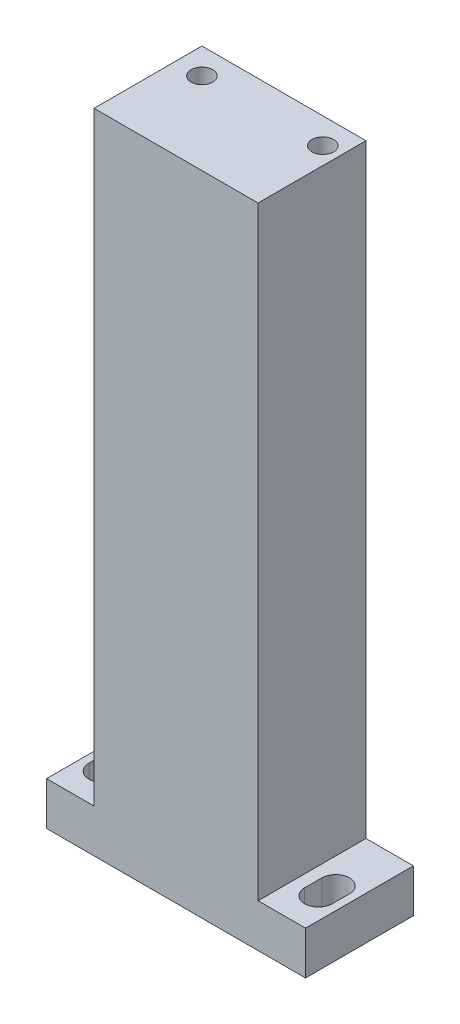
ISO-10303-21;
HEADER;
FILE_DESCRIPTION(('STEP AP214'),'2;1');
FILE_NAME('part.step','',(''),(''),'','','');
FILE_SCHEMA(('AUTOMOTIVE_DESIGN { 1 0 10303 214 1 1 1 1 }'));
ENDSEC;
DATA;
#1=APPLICATION_CONTEXT('core data for automotive mechanical design processes');
#2=APPLICATION_PROTOCOL_DEFINITION('international standard','automotive_design',2000,#1);
#3=PRODUCT_CONTEXT('',#1,'mechanical');
#4=PRODUCT('Part','Part','',(#3));
#5=PRODUCT_RELATED_PRODUCT_CATEGORY('part','',(#4));
#6=PRODUCT_DEFINITION_FORMATION('','',#4);
#7=PRODUCT_DEFINITION_CONTEXT('part definition',#1,'design');
#8=PRODUCT_DEFINITION('design','',#6,#7);
#9=PRODUCT_DEFINITION_SHAPE('','',#8);
#10=(LENGTH_UNIT() NAMED_UNIT(*) SI_UNIT(.MILLI.,.METRE.));
#11=(NAMED_UNIT(*) PLANE_ANGLE_UNIT() SI_UNIT($,.RADIAN.));
#12=(NAMED_UNIT(*) SI_UNIT($,.STERADIAN.) SOLID_ANGLE_UNIT());
#13=UNCERTAINTY_MEASURE_WITH_UNIT(LENGTH_MEASURE(1.E-05),#10,'distance_accuracy_value','');
#14=(GEOMETRIC_REPRESENTATION_CONTEXT(3) GLOBAL_UNCERTAINTY_ASSIGNED_CONTEXT((#13)) GLOBAL_UNIT_ASSIGNED_CONTEXT((#10,
#11,#12)) REPRESENTATION_CONTEXT('',''));
#15=CARTESIAN_POINT('',(0.,0.,0.));
#16=DIRECTION('',(0.,0.,1.));
#17=DIRECTION('',(1.,0.,0.));
#18=AXIS2_PLACEMENT_3D('',#15,#16,#17);
#19=CARTESIAN_POINT('',(0.,10.,0.));
#20=DIRECTION('',(0.,1.,0.));
#21=DIRECTION('',(0.,0.,1.));
#22=AXIS2_PLACEMENT_3D('',#19,#20,#21);
#23=PLANE('',#22);
#24=CARTESIAN_POINT('',(25.,10.,4.5));
#25=DIRECTION('',(0.,1.,0.));
#26=DIRECTION('',(0.,0.,1.));
#27=AXIS2_PLACEMENT_3D('',#24,#25,#26);
#28=CIRCLE('',#27,3.2);
#29=CARTESIAN_POINT('',(21.8,10.,4.5));
#30=VERTEX_POINT('',#29);
#31=CARTESIAN_POINT('',(28.2,10.,4.5));
#32=VERTEX_POINT('',#31);
#33=EDGE_CURVE('E55',#30,#32,#28,.T.);
#34=ORIENTED_EDGE('',*,*,#33,.F.);
#35=DIRECTION('',(0.,0.,1.));
#36=VECTOR('',#35,1.);
#37=CARTESIAN_POINT('',(21.8,10.,4.5));
#38=LINE('',#37,#36);
#39=CARTESIAN_POINT('',(21.8,10.,0.499999999999999));
#40=VERTEX_POINT('',#39);
#41=EDGE_CURVE('E204',#40,#30,#38,.T.);
#42=ORIENTED_EDGE('',*,*,#41,.F.);
#43=CARTESIAN_POINT('',(25.,10.,0.499999999999999));
#44=DIRECTION('',(0.,1.,0.));
#45=DIRECTION('',(0.,0.,1.));
#46=AXIS2_PLACEMENT_3D('',#43,#44,#45);
#47=CIRCLE('',#46,3.2);
#48=CARTESIAN_POINT('',(28.2,10.,0.499999999999998));
#49=VERTEX_POINT('',#48);
#50=EDGE_CURVE('E200',#49,#40,#47,.T.);
#51=ORIENTED_EDGE('',*,*,#50,.F.);
#52=DIRECTION('',(0.,0.,-1.));
#53=VECTOR('',#52,1.);
#54=CARTESIAN_POINT('',(28.2,10.,4.5));
#55=LINE('',#54,#53);
#56=EDGE_CURVE('E196',#32,#49,#55,.T.);
#57=ORIENTED_EDGE('',*,*,#56,.F.);
#58=EDGE_LOOP('',(#34,#42,#51,#57));
#59=FACE_BOUND('',#58,.T.);
#60=DIRECTION('',(0.,0.,-1.));
#61=VECTOR('',#60,1.);
#62=CARTESIAN_POINT('',(19.,10.,-12.5));
#63=LINE('',#62,#61);
#64=CARTESIAN_POINT('',(19.,10.,12.5));
#65=VERTEX_POINT('',#64);
#66=CARTESIAN_POINT('',(19.,10.,-12.5));
#67=VERTEX_POINT('',#66);
#68=EDGE_CURVE('E224',#65,#67,#63,.T.);
#69=ORIENTED_EDGE('',*,*,#68,.F.);
#70=DIRECTION('',(1.,0.,0.));
#71=VECTOR('',#70,1.);
#72=CARTESIAN_POINT('',(-30.,10.,12.5));
#73=LINE('',#72,#71);
#74=CARTESIAN_POINT('',(30.,10.,12.5));
#75=VERTEX_POINT('',#74);
#76=EDGE_CURVE('E285',#65,#75,#73,.T.);
#77=ORIENTED_EDGE('',*,*,#76,.T.);
#78=DIRECTION('',(0.,0.,-1.));
#79=VECTOR('',#78,1.);
#80=CARTESIAN_POINT('',(30.,10.,-12.5));
#81=LINE('',#80,#79);
#82=CARTESIAN_POINT('',(30.,10.,-12.5));
#83=VERTEX_POINT('',#82);
#84=EDGE_CURVE('E273',#75,#83,#81,.T.);
#85=ORIENTED_EDGE('',*,*,#84,.T.);
#86=DIRECTION('',(-1.,0.,0.));
#87=VECTOR('',#86,1.);
#88=CARTESIAN_POINT('',(-30.,10.,-12.5));
#89=LINE('',#88,#87);
#90=EDGE_CURVE('E279',#83,#67,#89,.T.);
#91=ORIENTED_EDGE('',*,*,#90,.T.);
#92=EDGE_LOOP('',(#69,#77,#85,#91));
#93=FACE_BOUND('',#92,.T.);
#94=ADVANCED_FACE('F39',(#59,#93),#23,.T.);
#95=CARTESIAN_POINT('',(30.,10.,-12.5));
#96=DIRECTION('',(-1.,0.,0.));
#97=DIRECTION('',(0.,0.,1.));
#98=AXIS2_PLACEMENT_3D('',#95,#96,#97);
#99=PLANE('',#98);
#100=DIRECTION('',(0.,0.,-1.));
#101=VECTOR('',#100,1.);
#102=CARTESIAN_POINT('',(30.,0.,-12.5));
#103=LINE('',#102,#101);
#104=CARTESIAN_POINT('',(30.,0.,12.5));
#105=VERTEX_POINT('',#104);
#106=CARTESIAN_POINT('',(30.,0.,-12.5));
#107=VERTEX_POINT('',#106);
#108=EDGE_CURVE('E272',#105,#107,#103,.T.);
#109=ORIENTED_EDGE('',*,*,#108,.T.);
#110=DIRECTION('',(0.,-1.,0.));
#111=VECTOR('',#110,1.);
#112=CARTESIAN_POINT('',(30.,10.,-12.5));
#113=LINE('',#112,#111);
#114=EDGE_CURVE('E312',#83,#107,#113,.T.);
#115=ORIENTED_EDGE('',*,*,#114,.F.);
#116=ORIENTED_EDGE('',*,*,#84,.F.);
#117=DIRECTION('',(0.,-1.,0.));
#118=VECTOR('',#117,1.);
#119=CARTESIAN_POINT('',(30.,10.,12.5));
#120=LINE('',#119,#118);
#121=EDGE_CURVE('E289',#75,#105,#120,.T.);
#122=ORIENTED_EDGE('',*,*,#121,.T.);
#123=EDGE_LOOP('',(#109,#115,#116,#122));
#124=FACE_BOUND('',#123,.T.);
#125=ADVANCED_FACE('F41',(#124),#99,.F.);
#126=CARTESIAN_POINT('',(-30.,10.,-12.5));
#127=DIRECTION('',(0.,0.,1.));
#128=DIRECTION('',(1.,0.,0.));
#129=AXIS2_PLACEMENT_3D('',#126,#127,#128);
#130=PLANE('',#129);
#131=DIRECTION('',(-1.,0.,0.));
#132=VECTOR('',#131,1.);
#133=CARTESIAN_POINT('',(-30.,0.,-12.5));
#134=LINE('',#133,#132);
#135=CARTESIAN_POINT('',(-30.,0.,-12.5));
#136=VERTEX_POINT('',#135);
#137=EDGE_CURVE('E293',#107,#136,#134,.T.);
#138=ORIENTED_EDGE('',*,*,#137,.T.);
#139=DIRECTION('',(0.,-1.,0.));
#140=VECTOR('',#139,1.);
#141=CARTESIAN_POINT('',(-30.,10.,-12.5));
#142=LINE('',#141,#140);
#143=CARTESIAN_POINT('',(-30.,10.,-12.5));
#144=VERTEX_POINT('',#143);
#145=EDGE_CURVE('E308',#144,#136,#142,.T.);
#146=ORIENTED_EDGE('',*,*,#145,.F.);
#147=CARTESIAN_POINT('',(-19.,10.,-12.5));
#148=VERTEX_POINT('',#147);
#149=EDGE_CURVE('E277',#148,#144,#89,.T.);
#150=ORIENTED_EDGE('',*,*,#149,.F.);
#151=DIRECTION('',(0.,-1.,0.));
#152=VECTOR('',#151,1.);
#153=CARTESIAN_POINT('',(-19.,150.,-12.5));
#154=LINE('',#153,#152);
#155=CARTESIAN_POINT('',(-19.,150.,-12.5));
#156=VERTEX_POINT('',#155);
#157=EDGE_CURVE('E264',#156,#148,#154,.T.);
#158=ORIENTED_EDGE('',*,*,#157,.F.);
#159=DIRECTION('',(-1.,0.,0.));
#160=VECTOR('',#159,1.);
#161=CARTESIAN_POINT('',(-19.,150.,-12.5));
#162=LINE('',#161,#160);
#163=CARTESIAN_POINT('',(19.,150.,-12.5));
#164=VERTEX_POINT('',#163);
#165=EDGE_CURVE('E240',#164,#156,#162,.T.);
#166=ORIENTED_EDGE('',*,*,#165,.F.);
#167=DIRECTION('',(0.,-1.,0.));
#168=VECTOR('',#167,1.);
#169=CARTESIAN_POINT('',(19.,150.,-12.5));
#170=LINE('',#169,#168);
#171=EDGE_CURVE('E268',#164,#67,#170,.T.);
#172=ORIENTED_EDGE('',*,*,#171,.T.);
#173=ORIENTED_EDGE('',*,*,#90,.F.);
#174=ORIENTED_EDGE('',*,*,#114,.T.);
#175=EDGE_LOOP('',(#138,#146,#150,#158,#166,#172,#173,#174));
#176=FACE_BOUND('',#175,.T.);
#177=ADVANCED_FACE('F364',(#176),#130,.F.);
#178=CARTESIAN_POINT('',(-30.,10.,-12.5));
#179=DIRECTION('',(1.,0.,0.));
#180=DIRECTION('',(0.,0.,-1.));
#181=AXIS2_PLACEMENT_3D('',#178,#179,#180);
#182=PLANE('',#181);
#183=DIRECTION('',(0.,0.,1.));
#184=VECTOR('',#183,1.);
#185=CARTESIAN_POINT('',(-30.,0.,-12.5));
#186=LINE('',#185,#184);
#187=CARTESIAN_POINT('',(-30.,0.,12.5));
#188=VERTEX_POINT('',#187);
#189=EDGE_CURVE('E296',#136,#188,#186,.T.);
#190=ORIENTED_EDGE('',*,*,#189,.T.);
#191=DIRECTION('',(0.,-1.,0.));
#192=VECTOR('',#191,1.);
#193=CARTESIAN_POINT('',(-30.,10.,12.5));
#194=LINE('',#193,#192);
#195=CARTESIAN_POINT('',(-30.,10.,12.5));
#196=VERTEX_POINT('',#195);
#197=EDGE_CURVE('E304',#196,#188,#194,.T.);
#198=ORIENTED_EDGE('',*,*,#197,.F.);
#199=DIRECTION('',(0.,0.,1.));
#200=VECTOR('',#199,1.);
#201=CARTESIAN_POINT('',(-30.,10.,-12.5));
#202=LINE('',#201,#200);
#203=EDGE_CURVE('E282',#144,#196,#202,.T.);
#204=ORIENTED_EDGE('',*,*,#203,.F.);
#205=ORIENTED_EDGE('',*,*,#145,.T.);
#206=EDGE_LOOP('',(#190,#198,#204,#205));
#207=FACE_BOUND('',#206,.T.);
#208=ADVANCED_FACE('F376',(#207),#182,.F.);
#209=CARTESIAN_POINT('',(-30.,10.,12.5));
#210=DIRECTION('',(0.,0.,-1.));
#211=DIRECTION('',(-1.,0.,0.));
#212=AXIS2_PLACEMENT_3D('',#209,#210,#211);
#213=PLANE('',#212);
#214=DIRECTION('',(1.,0.,0.));
#215=VECTOR('',#214,1.);
#216=CARTESIAN_POINT('',(-30.,0.,12.5));
#217=LINE('',#216,#215);
#218=EDGE_CURVE('E278',#188,#105,#217,.T.);
#219=ORIENTED_EDGE('',*,*,#218,.T.);
#220=ORIENTED_EDGE('',*,*,#121,.F.);
#221=ORIENTED_EDGE('',*,*,#76,.F.);
#222=DIRECTION('',(0.,-1.,0.));
#223=VECTOR('',#222,1.);
#224=CARTESIAN_POINT('',(19.,150.,12.5));
#225=LINE('',#224,#223);
#226=CARTESIAN_POINT('',(19.,150.,12.5));
#227=VERTEX_POINT('',#226);
#228=EDGE_CURVE('E250',#227,#65,#225,.T.);
#229=ORIENTED_EDGE('',*,*,#228,.F.);
#230=DIRECTION('',(1.,0.,0.));
#231=VECTOR('',#230,1.);
#232=CARTESIAN_POINT('',(-19.,150.,12.5));
#233=LINE('',#232,#231);
#234=CARTESIAN_POINT('',(-19.,150.,12.5));
#235=VERTEX_POINT('',#234);
#236=EDGE_CURVE('E247',#235,#227,#233,.T.);
#237=ORIENTED_EDGE('',*,*,#236,.F.);
#238=DIRECTION('',(0.,-1.,0.));
#239=VECTOR('',#238,1.);
#240=CARTESIAN_POINT('',(-19.,150.,12.5));
#241=LINE('',#240,#239);
#242=CARTESIAN_POINT('',(-19.,10.,12.5));
#243=VERTEX_POINT('',#242);
#244=EDGE_CURVE('E260',#235,#243,#241,.T.);
#245=ORIENTED_EDGE('',*,*,#244,.T.);
#246=EDGE_CURVE('E286',#196,#243,#73,.T.);
#247=ORIENTED_EDGE('',*,*,#246,.F.);
#248=ORIENTED_EDGE('',*,*,#197,.T.);
#249=EDGE_LOOP('',(#219,#220,#221,#229,#237,#245,#247,#248));
#250=FACE_BOUND('',#249,.T.);
#251=ADVANCED_FACE('F370',(#250),#213,.F.);
#252=CARTESIAN_POINT('',(-25.,10.,4.5));
#253=DIRECTION('',(0.,1.,0.));
#254=DIRECTION('',(0.,0.,1.));
#255=AXIS2_PLACEMENT_3D('',#252,#253,#254);
#256=CIRCLE('',#255,3.20000000000001);
#257=CARTESIAN_POINT('',(-28.2,10.,4.5));
#258=VERTEX_POINT('',#257);
#259=CARTESIAN_POINT('',(-21.8,10.,4.5));
#260=VERTEX_POINT('',#259);
#261=EDGE_CURVE('E63',#258,#260,#256,.T.);
#262=ORIENTED_EDGE('',*,*,#261,.F.);
#263=DIRECTION('',(0.,0.,1.));
#264=VECTOR('',#263,1.);
#265=CARTESIAN_POINT('',(-28.2,10.,4.5));
#266=LINE('',#265,#264);
#267=CARTESIAN_POINT('',(-28.2,10.,0.5));
#268=VERTEX_POINT('',#267);
#269=EDGE_CURVE('E179',#268,#258,#266,.T.);
#270=ORIENTED_EDGE('',*,*,#269,.F.);
#271=CARTESIAN_POINT('',(-25.,10.,0.499999999999999));
#272=DIRECTION('',(0.,1.,0.));
#273=DIRECTION('',(0.,0.,1.));
#274=AXIS2_PLACEMENT_3D('',#271,#272,#273);
#275=CIRCLE('',#274,3.20000000000001);
#276=CARTESIAN_POINT('',(-21.8,10.,0.499999999999998));
#277=VERTEX_POINT('',#276);
#278=EDGE_CURVE('E160',#277,#268,#275,.T.);
#279=ORIENTED_EDGE('',*,*,#278,.F.);
#280=DIRECTION('',(0.,0.,-1.));
#281=VECTOR('',#280,1.);
#282=CARTESIAN_POINT('',(-21.8,10.,4.5));
#283=LINE('',#282,#281);
#284=EDGE_CURVE('E171',#260,#277,#283,.T.);
#285=ORIENTED_EDGE('',*,*,#284,.F.);
#286=EDGE_LOOP('',(#262,#270,#279,#285));
#287=FACE_BOUND('',#286,.T.);
#288=DIRECTION('',(0.,0.,1.));
#289=VECTOR('',#288,1.);
#290=CARTESIAN_POINT('',(-19.,10.,-12.5));
#291=LINE('',#290,#289);
#292=EDGE_CURVE('E241',#148,#243,#291,.T.);
#293=ORIENTED_EDGE('',*,*,#292,.F.);
#294=ORIENTED_EDGE('',*,*,#149,.T.);
#295=ORIENTED_EDGE('',*,*,#203,.T.);
#296=ORIENTED_EDGE('',*,*,#246,.T.);
#297=EDGE_LOOP('',(#293,#294,#295,#296));
#298=FACE_BOUND('',#297,.T.);
#299=ADVANCED_FACE('F176',(#287,#298),#23,.T.);
#300=CARTESIAN_POINT('',(0.,0.,0.));
#301=DIRECTION('',(0.,1.,0.));
#302=DIRECTION('',(0.,0.,1.));
#303=AXIS2_PLACEMENT_3D('',#300,#301,#302);
#304=PLANE('',#303);
#305=DIRECTION('',(0.,0.,1.));
#306=VECTOR('',#305,1.);
#307=CARTESIAN_POINT('',(-28.2,0.,0.));
#308=LINE('',#307,#306);
#309=CARTESIAN_POINT('',(-28.2,0.,0.5));
#310=VERTEX_POINT('',#309);
#311=CARTESIAN_POINT('',(-28.2,0.,4.5));
#312=VERTEX_POINT('',#311);
#313=EDGE_CURVE('E48',#310,#312,#308,.T.);
#314=ORIENTED_EDGE('',*,*,#313,.T.);
#315=CARTESIAN_POINT('',(-25.,0.,4.5));
#316=DIRECTION('',(0.,1.,0.));
#317=DIRECTION('',(0.,0.,1.));
#318=AXIS2_PLACEMENT_3D('',#315,#316,#317);
#319=CIRCLE('',#318,3.20000000000001);
#320=CARTESIAN_POINT('',(-21.8,0.,4.5));
#321=VERTEX_POINT('',#320);
#322=EDGE_CURVE('E11',#312,#321,#319,.T.);
#323=ORIENTED_EDGE('',*,*,#322,.T.);
#324=DIRECTION('',(0.,0.,-1.));
#325=VECTOR('',#324,1.);
#326=CARTESIAN_POINT('',(-21.8,0.,0.));
#327=LINE('',#326,#325);
#328=CARTESIAN_POINT('',(-21.8,0.,0.499999999999998));
#329=VERTEX_POINT('',#328);
#330=EDGE_CURVE('E332',#321,#329,#327,.T.);
#331=ORIENTED_EDGE('',*,*,#330,.T.);
#332=CARTESIAN_POINT('',(-25.,0.,0.499999999999999));
#333=DIRECTION('',(0.,1.,0.));
#334=DIRECTION('',(0.,0.,1.));
#335=AXIS2_PLACEMENT_3D('',#332,#333,#334);
#336=CIRCLE('',#335,3.20000000000001);
#337=EDGE_CURVE('E163',#329,#310,#336,.T.);
#338=ORIENTED_EDGE('',*,*,#337,.T.);
#339=EDGE_LOOP('',(#314,#323,#331,#338));
#340=FACE_BOUND('',#339,.T.);
#341=DIRECTION('',(0.,0.,1.));
#342=VECTOR('',#341,1.);
#343=CARTESIAN_POINT('',(21.8,0.,0.));
#344=LINE('',#343,#342);
#345=CARTESIAN_POINT('',(21.8,0.,0.499999999999999));
#346=VERTEX_POINT('',#345);
#347=CARTESIAN_POINT('',(21.8,0.,4.5));
#348=VERTEX_POINT('',#347);
#349=EDGE_CURVE('E324',#346,#348,#344,.T.);
#350=ORIENTED_EDGE('',*,*,#349,.T.);
#351=CARTESIAN_POINT('',(25.,0.,4.5));
#352=DIRECTION('',(0.,1.,0.));
#353=DIRECTION('',(0.,0.,1.));
#354=AXIS2_PLACEMENT_3D('',#351,#352,#353);
#355=CIRCLE('',#354,3.2);
#356=CARTESIAN_POINT('',(28.2,0.,4.5));
#357=VERTEX_POINT('',#356);
#358=EDGE_CURVE('E328',#348,#357,#355,.T.);
#359=ORIENTED_EDGE('',*,*,#358,.T.);
#360=DIRECTION('',(0.,0.,-1.));
#361=VECTOR('',#360,1.);
#362=CARTESIAN_POINT('',(28.2,0.,0.));
#363=LINE('',#362,#361);
#364=CARTESIAN_POINT('',(28.2,0.,0.499999999999998));
#365=VERTEX_POINT('',#364);
#366=EDGE_CURVE('E316',#357,#365,#363,.T.);
#367=ORIENTED_EDGE('',*,*,#366,.T.);
#368=CARTESIAN_POINT('',(25.,0.,0.499999999999999));
#369=DIRECTION('',(0.,1.,0.));
#370=DIRECTION('',(0.,0.,1.));
#371=AXIS2_PLACEMENT_3D('',#368,#369,#370);
#372=CIRCLE('',#371,3.2);
#373=EDGE_CURVE('E320',#365,#346,#372,.T.);
#374=ORIENTED_EDGE('',*,*,#373,.T.);
#375=EDGE_LOOP('',(#350,#359,#367,#374));
#376=FACE_BOUND('',#375,.T.);
#377=ORIENTED_EDGE('',*,*,#108,.F.);
#378=ORIENTED_EDGE('',*,*,#218,.F.);
#379=ORIENTED_EDGE('',*,*,#189,.F.);
#380=ORIENTED_EDGE('',*,*,#137,.F.);
#381=EDGE_LOOP('',(#377,#378,#379,#380));
#382=FACE_BOUND('',#381,.T.);
#383=ADVANCED_FACE('F339',(#340,#376,#382),#304,.F.);
#384=CARTESIAN_POINT('',(19.,150.,-12.5));
#385=DIRECTION('',(-1.,0.,0.));
#386=DIRECTION('',(0.,0.,1.));
#387=AXIS2_PLACEMENT_3D('',#384,#385,#386);
#388=PLANE('',#387);
#389=ORIENTED_EDGE('',*,*,#68,.T.);
#390=ORIENTED_EDGE('',*,*,#171,.F.);
#391=DIRECTION('',(0.,0.,-1.));
#392=VECTOR('',#391,1.);
#393=CARTESIAN_POINT('',(19.,150.,-12.5));
#394=LINE('',#393,#392);
#395=EDGE_CURVE('E236',#227,#164,#394,.T.);
#396=ORIENTED_EDGE('',*,*,#395,.F.);
#397=ORIENTED_EDGE('',*,*,#228,.T.);
#398=EDGE_LOOP('',(#389,#390,#396,#397));
#399=FACE_BOUND('',#398,.T.);
#400=ADVANCED_FACE('F375',(#399),#388,.F.);
#401=CARTESIAN_POINT('',(-19.,150.,-12.5));
#402=DIRECTION('',(1.,0.,0.));
#403=DIRECTION('',(0.,0.,-1.));
#404=AXIS2_PLACEMENT_3D('',#401,#402,#403);
#405=PLANE('',#404);
#406=ORIENTED_EDGE('',*,*,#292,.T.);
#407=ORIENTED_EDGE('',*,*,#244,.F.);
#408=DIRECTION('',(0.,0.,1.));
#409=VECTOR('',#408,1.);
#410=CARTESIAN_POINT('',(-19.,150.,-12.5));
#411=LINE('',#410,#409);
#412=EDGE_CURVE('E244',#156,#235,#411,.T.);
#413=ORIENTED_EDGE('',*,*,#412,.F.);
#414=ORIENTED_EDGE('',*,*,#157,.T.);
#415=EDGE_LOOP('',(#406,#407,#413,#414));
#416=FACE_BOUND('',#415,.T.);
#417=ADVANCED_FACE('F407',(#416),#405,.F.);
#418=CARTESIAN_POINT('',(0.,150.,0.));
#419=DIRECTION('',(0.,1.,0.));
#420=DIRECTION('',(0.,0.,1.));
#421=AXIS2_PLACEMENT_3D('',#418,#419,#420);
#422=PLANE('',#421);
#423=CARTESIAN_POINT('',(-13.,150.,-6.5));
#424=DIRECTION('',(0.,1.,0.));
#425=DIRECTION('',(0.,0.,1.));
#426=AXIS2_PLACEMENT_3D('',#423,#424,#425);
#427=CIRCLE('',#426,2.5);
#428=CARTESIAN_POINT('',(-13.,150.,-4.));
#429=VERTEX_POINT('',#428);
#430=EDGE_CURVE('E225',#429,#429,#427,.T.);
#431=ORIENTED_EDGE('',*,*,#430,.F.);
#432=EDGE_LOOP('',(#431));
#433=FACE_BOUND('',#432,.T.);
#434=CARTESIAN_POINT('',(15.,150.,-6.5));
#435=DIRECTION('',(0.,1.,0.));
#436=DIRECTION('',(0.,0.,1.));
#437=AXIS2_PLACEMENT_3D('',#434,#435,#436);
#438=CIRCLE('',#437,2.49999999999999);
#439=CARTESIAN_POINT('',(15.,150.,-4.00000000000001));
#440=VERTEX_POINT('',#439);
#441=EDGE_CURVE('E189',#440,#440,#438,.T.);
#442=ORIENTED_EDGE('',*,*,#441,.F.);
#443=EDGE_LOOP('',(#442));
#444=FACE_BOUND('',#443,.T.);
#445=ORIENTED_EDGE('',*,*,#395,.T.);
#446=ORIENTED_EDGE('',*,*,#165,.T.);
#447=ORIENTED_EDGE('',*,*,#412,.T.);
#448=ORIENTED_EDGE('',*,*,#236,.T.);
#449=EDGE_LOOP('',(#445,#446,#447,#448));
#450=FACE_BOUND('',#449,.T.);
#451=ADVANCED_FACE('F411',(#433,#444,#450),#422,.T.);
#452=CARTESIAN_POINT('',(15.,130.,-6.5));
#453=DIRECTION('',(0.,1.,0.));
#454=DIRECTION('',(0.,0.,1.));
#455=AXIS2_PLACEMENT_3D('',#452,#453,#454);
#456=CYLINDRICAL_SURFACE('',#455,2.49999999999999);
#457=CARTESIAN_POINT('',(15.,130.,-6.5));
#458=DIRECTION('',(0.,1.,0.));
#459=DIRECTION('',(0.,0.,1.));
#460=AXIS2_PLACEMENT_3D('',#457,#458,#459);
#461=CIRCLE('',#460,2.49999999999999);
#462=CARTESIAN_POINT('',(15.,130.,-4.00000000000001));
#463=VERTEX_POINT('',#462);
#464=EDGE_CURVE('E229',#463,#463,#461,.T.);
#465=ORIENTED_EDGE('',*,*,#464,.F.);
#466=EDGE_LOOP('',(#465));
#467=FACE_BOUND('',#466,.T.);
#468=ORIENTED_EDGE('',*,*,#441,.T.);
#469=EDGE_LOOP('',(#468));
#470=FACE_BOUND('',#469,.T.);
#471=ADVANCED_FACE('F423',(#467,#470),#456,.F.);
#472=CARTESIAN_POINT('',(15.,130.,-6.5));
#473=DIRECTION('',(0.,1.,0.));
#474=DIRECTION('',(0.,0.,1.));
#475=AXIS2_PLACEMENT_3D('',#472,#473,#474);
#476=PLANE('',#475);
#477=ORIENTED_EDGE('',*,*,#464,.T.);
#478=EDGE_LOOP('',(#477));
#479=FACE_BOUND('',#478,.T.);
#480=ADVANCED_FACE('F427',(#479),#476,.T.);
#481=CARTESIAN_POINT('',(-13.,130.,-6.5));
#482=DIRECTION('',(0.,1.,0.));
#483=DIRECTION('',(0.,0.,1.));
#484=AXIS2_PLACEMENT_3D('',#481,#482,#483);
#485=CYLINDRICAL_SURFACE('',#484,2.5);
#486=CARTESIAN_POINT('',(-13.,130.,-6.5));
#487=DIRECTION('',(0.,1.,0.));
#488=DIRECTION('',(0.,0.,1.));
#489=AXIS2_PLACEMENT_3D('',#486,#487,#488);
#490=CIRCLE('',#489,2.5);
#491=CARTESIAN_POINT('',(-13.,130.,-4.));
#492=VERTEX_POINT('',#491);
#493=EDGE_CURVE('E220',#492,#492,#490,.T.);
#494=ORIENTED_EDGE('',*,*,#493,.F.);
#495=EDGE_LOOP('',(#494));
#496=FACE_BOUND('',#495,.T.);
#497=ORIENTED_EDGE('',*,*,#430,.T.);
#498=EDGE_LOOP('',(#497));
#499=FACE_BOUND('',#498,.T.);
#500=ADVANCED_FACE('F431',(#496,#499),#485,.F.);
#501=CARTESIAN_POINT('',(-13.,130.,-6.5));
#502=DIRECTION('',(0.,1.,0.));
#503=DIRECTION('',(0.,0.,1.));
#504=AXIS2_PLACEMENT_3D('',#501,#502,#503);
#505=PLANE('',#504);
#506=ORIENTED_EDGE('',*,*,#493,.T.);
#507=EDGE_LOOP('',(#506));
#508=FACE_BOUND('',#507,.T.);
#509=ADVANCED_FACE('F435',(#508),#505,.T.);
#510=CARTESIAN_POINT('',(25.,-10.,4.5));
#511=DIRECTION('',(0.,1.,0.));
#512=DIRECTION('',(0.,0.,1.));
#513=AXIS2_PLACEMENT_3D('',#510,#511,#512);
#514=CYLINDRICAL_SURFACE('',#513,3.2);
#515=DIRECTION('',(0.,1.,0.));
#516=VECTOR('',#515,1.);
#517=CARTESIAN_POINT('',(21.8,-10.,4.5));
#518=LINE('',#517,#516);
#519=EDGE_CURVE('E209',#348,#30,#518,.T.);
#520=ORIENTED_EDGE('',*,*,#519,.T.);
#521=ORIENTED_EDGE('',*,*,#33,.T.);
#522=DIRECTION('',(0.,1.,0.));
#523=VECTOR('',#522,1.);
#524=CARTESIAN_POINT('',(28.2,-10.,4.5));
#525=LINE('',#524,#523);
#526=EDGE_CURVE('E208',#357,#32,#525,.T.);
#527=ORIENTED_EDGE('',*,*,#526,.F.);
#528=ORIENTED_EDGE('',*,*,#358,.F.);
#529=EDGE_LOOP('',(#520,#521,#527,#528));
#530=FACE_BOUND('',#529,.T.);
#531=ADVANCED_FACE('F439',(#530),#514,.F.);
#532=CARTESIAN_POINT('',(21.8,-10.,4.5));
#533=DIRECTION('',(-1.,0.,0.));
#534=DIRECTION('',(0.,0.,1.));
#535=AXIS2_PLACEMENT_3D('',#532,#533,#534);
#536=PLANE('',#535);
#537=DIRECTION('',(0.,1.,0.));
#538=VECTOR('',#537,1.);
#539=CARTESIAN_POINT('',(21.8,-10.,0.499999999999999));
#540=LINE('',#539,#538);
#541=EDGE_CURVE('E212',#346,#40,#540,.T.);
#542=ORIENTED_EDGE('',*,*,#541,.T.);
#543=ORIENTED_EDGE('',*,*,#41,.T.);
#544=ORIENTED_EDGE('',*,*,#519,.F.);
#545=ORIENTED_EDGE('',*,*,#349,.F.);
#546=EDGE_LOOP('',(#542,#543,#544,#545));
#547=FACE_BOUND('',#546,.T.);
#548=ADVANCED_FACE('F442',(#547),#536,.F.);
#549=CARTESIAN_POINT('',(25.,-10.,0.499999999999999));
#550=DIRECTION('',(0.,1.,0.));
#551=DIRECTION('',(0.,0.,1.));
#552=AXIS2_PLACEMENT_3D('',#549,#550,#551);
#553=CYLINDRICAL_SURFACE('',#552,3.2);
#554=DIRECTION('',(0.,1.,0.));
#555=VECTOR('',#554,1.);
#556=CARTESIAN_POINT('',(28.2,-10.,0.499999999999998));
#557=LINE('',#556,#555);
#558=EDGE_CURVE('E215',#365,#49,#557,.T.);
#559=ORIENTED_EDGE('',*,*,#558,.T.);
#560=ORIENTED_EDGE('',*,*,#50,.T.);
#561=ORIENTED_EDGE('',*,*,#541,.F.);
#562=ORIENTED_EDGE('',*,*,#373,.F.);
#563=EDGE_LOOP('',(#559,#560,#561,#562));
#564=FACE_BOUND('',#563,.T.);
#565=ADVANCED_FACE('F353',(#564),#553,.F.);
#566=CARTESIAN_POINT('',(28.2,-10.,4.5));
#567=DIRECTION('',(1.,0.,0.));
#568=DIRECTION('',(0.,0.,-1.));
#569=AXIS2_PLACEMENT_3D('',#566,#567,#568);
#570=PLANE('',#569);
#571=ORIENTED_EDGE('',*,*,#526,.T.);
#572=ORIENTED_EDGE('',*,*,#56,.T.);
#573=ORIENTED_EDGE('',*,*,#558,.F.);
#574=ORIENTED_EDGE('',*,*,#366,.F.);
#575=EDGE_LOOP('',(#571,#572,#573,#574));
#576=FACE_BOUND('',#575,.T.);
#577=ADVANCED_FACE('F346',(#576),#570,.F.);
#578=CARTESIAN_POINT('',(-25.,-10.,4.5));
#579=DIRECTION('',(0.,1.,0.));
#580=DIRECTION('',(0.,0.,1.));
#581=AXIS2_PLACEMENT_3D('',#578,#579,#580);
#582=CYLINDRICAL_SURFACE('',#581,3.20000000000001);
#583=DIRECTION('',(0.,1.,0.));
#584=VECTOR('',#583,1.);
#585=CARTESIAN_POINT('',(-28.2,-10.,4.5));
#586=LINE('',#585,#584);
#587=EDGE_CURVE('E186',#312,#258,#586,.T.);
#588=ORIENTED_EDGE('',*,*,#587,.T.);
#589=ORIENTED_EDGE('',*,*,#261,.T.);
#590=DIRECTION('',(0.,1.,0.));
#591=VECTOR('',#590,1.);
#592=CARTESIAN_POINT('',(-21.8,-10.,4.5));
#593=LINE('',#592,#591);
#594=EDGE_CURVE('E168',#321,#260,#593,.T.);
#595=ORIENTED_EDGE('',*,*,#594,.F.);
#596=ORIENTED_EDGE('',*,*,#322,.F.);
#597=EDGE_LOOP('',(#588,#589,#595,#596));
#598=FACE_BOUND('',#597,.T.);
#599=ADVANCED_FACE('F344',(#598),#582,.F.);
#600=CARTESIAN_POINT('',(-28.2,-10.,4.5));
#601=DIRECTION('',(-1.,0.,0.));
#602=DIRECTION('',(0.,0.,1.));
#603=AXIS2_PLACEMENT_3D('',#600,#601,#602);
#604=PLANE('',#603);
#605=DIRECTION('',(0.,1.,0.));
#606=VECTOR('',#605,1.);
#607=CARTESIAN_POINT('',(-28.2,-10.,0.5));
#608=LINE('',#607,#606);
#609=EDGE_CURVE('E167',#310,#268,#608,.T.);
#610=ORIENTED_EDGE('',*,*,#609,.T.);
#611=ORIENTED_EDGE('',*,*,#269,.T.);
#612=ORIENTED_EDGE('',*,*,#587,.F.);
#613=ORIENTED_EDGE('',*,*,#313,.F.);
#614=EDGE_LOOP('',(#610,#611,#612,#613));
#615=FACE_BOUND('',#614,.T.);
#616=ADVANCED_FACE('F343',(#615),#604,.F.);
#617=CARTESIAN_POINT('',(-25.,-10.,0.499999999999999));
#618=DIRECTION('',(0.,1.,0.));
#619=DIRECTION('',(0.,0.,1.));
#620=AXIS2_PLACEMENT_3D('',#617,#618,#619);
#621=CYLINDRICAL_SURFACE('',#620,3.20000000000001);
#622=DIRECTION('',(0.,1.,0.));
#623=VECTOR('',#622,1.);
#624=CARTESIAN_POINT('',(-21.8,-10.,0.499999999999998));
#625=LINE('',#624,#623);
#626=EDGE_CURVE('E155',#329,#277,#625,.T.);
#627=ORIENTED_EDGE('',*,*,#626,.T.);
#628=ORIENTED_EDGE('',*,*,#278,.T.);
#629=ORIENTED_EDGE('',*,*,#609,.F.);
#630=ORIENTED_EDGE('',*,*,#337,.F.);
#631=EDGE_LOOP('',(#627,#628,#629,#630));
#632=FACE_BOUND('',#631,.T.);
#633=ADVANCED_FACE('F157',(#632),#621,.F.);
#634=CARTESIAN_POINT('',(-21.8,-10.,4.5));
#635=DIRECTION('',(1.,0.,0.));
#636=DIRECTION('',(0.,0.,-1.));
#637=AXIS2_PLACEMENT_3D('',#634,#635,#636);
#638=PLANE('',#637);
#639=ORIENTED_EDGE('',*,*,#594,.T.);
#640=ORIENTED_EDGE('',*,*,#284,.T.);
#641=ORIENTED_EDGE('',*,*,#626,.F.);
#642=ORIENTED_EDGE('',*,*,#330,.F.);
#643=EDGE_LOOP('',(#639,#640,#641,#642));
#644=FACE_BOUND('',#643,.T.);
#645=ADVANCED_FACE('F172',(#644),#638,.F.);
#646=CLOSED_SHELL('',(#94,#125,#177,#208,#251,#299,#383,#400,#417,#451,#471,#480,#500,#509,#531,
#548,#565,#577,#599,#616,#633,#645));
#647=MANIFOLD_SOLID_BREP('B2',#646);
#648=ADVANCED_BREP_SHAPE_REPRESENTATION('',(#18,#647),#14);
#649=SHAPE_DEFINITION_REPRESENTATION(#9,#648);
ENDSEC;
END-ISO-10303-21;
